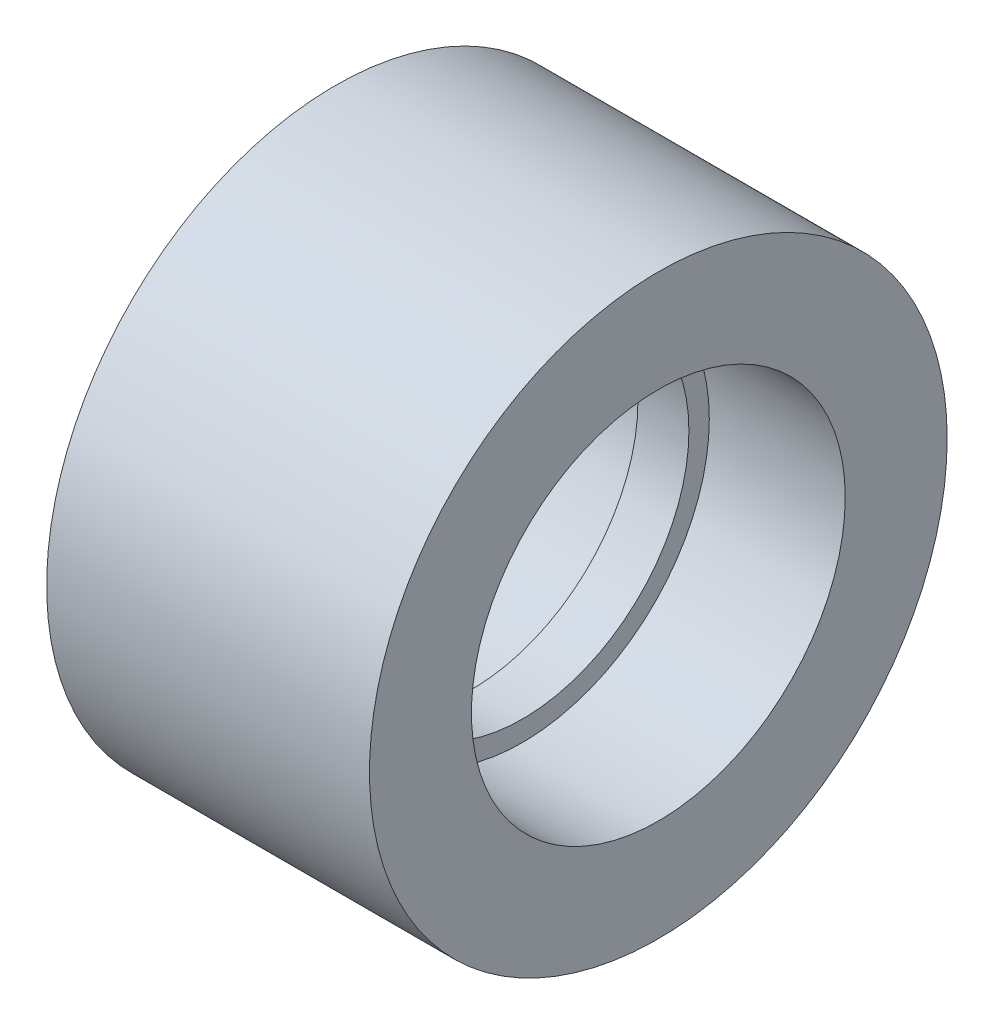
ISO-10303-21;
HEADER;
FILE_DESCRIPTION(('STEP AP214'),'2;1');
FILE_NAME('part.step','',(''),(''),'','','');
FILE_SCHEMA(('AUTOMOTIVE_DESIGN { 1 0 10303 214 1 1 1 1 }'));
ENDSEC;
DATA;
#1=APPLICATION_CONTEXT('core data for automotive mechanical design processes');
#2=APPLICATION_PROTOCOL_DEFINITION('international standard','automotive_design',2000,#1);
#3=PRODUCT_CONTEXT('',#1,'mechanical');
#4=PRODUCT('Part','Part','',(#3));
#5=PRODUCT_RELATED_PRODUCT_CATEGORY('part','',(#4));
#6=PRODUCT_DEFINITION_FORMATION('','',#4);
#7=PRODUCT_DEFINITION_CONTEXT('part definition',#1,'design');
#8=PRODUCT_DEFINITION('design','',#6,#7);
#9=PRODUCT_DEFINITION_SHAPE('','',#8);
#10=(LENGTH_UNIT() NAMED_UNIT(*) SI_UNIT(.MILLI.,.METRE.));
#11=(NAMED_UNIT(*) PLANE_ANGLE_UNIT() SI_UNIT($,.RADIAN.));
#12=(NAMED_UNIT(*) SI_UNIT($,.STERADIAN.) SOLID_ANGLE_UNIT());
#13=UNCERTAINTY_MEASURE_WITH_UNIT(LENGTH_MEASURE(1.E-05),#10,'distance_accuracy_value','');
#14=(GEOMETRIC_REPRESENTATION_CONTEXT(3) GLOBAL_UNCERTAINTY_ASSIGNED_CONTEXT((#13)) GLOBAL_UNIT_ASSIGNED_CONTEXT((#10,
#11,#12)) REPRESENTATION_CONTEXT('',''));
#15=CARTESIAN_POINT('',(0.,0.,0.));
#16=DIRECTION('',(0.,0.,1.));
#17=DIRECTION('',(1.,0.,0.));
#18=AXIS2_PLACEMENT_3D('',#15,#16,#17);
#19=CARTESIAN_POINT('',(-9.5,0.,-17.));
#20=DIRECTION('',(-1.,0.,0.));
#21=DIRECTION('',(0.,0.,1.));
#22=AXIS2_PLACEMENT_3D('',#19,#20,#21);
#23=PLANE('',#22);
#24=CARTESIAN_POINT('',(-9.49999999999999,0.,0.));
#25=DIRECTION('',(1.,0.,0.));
#26=DIRECTION('',(0.,0.,-1.));
#27=AXIS2_PLACEMENT_3D('',#24,#25,#26);
#28=CIRCLE('',#27,11.);
#29=CARTESIAN_POINT('',(-9.49999999999999,0.,-11.));
#30=VERTEX_POINT('',#29);
#31=EDGE_CURVE('E10',#30,#30,#28,.T.);
#32=ORIENTED_EDGE('',*,*,#31,.T.);
#33=EDGE_LOOP('',(#32));
#34=FACE_BOUND('',#33,.T.);
#35=CARTESIAN_POINT('',(-9.49999999999999,0.,0.));
#36=DIRECTION('',(1.,0.,0.));
#37=DIRECTION('',(0.,0.,-1.));
#38=AXIS2_PLACEMENT_3D('',#35,#36,#37);
#39=CIRCLE('',#38,17.);
#40=CARTESIAN_POINT('',(-9.49999999999999,0.,-17.));
#41=VERTEX_POINT('',#40);
#42=EDGE_CURVE('E63',#41,#41,#39,.T.);
#43=ORIENTED_EDGE('',*,*,#42,.F.);
#44=EDGE_LOOP('',(#43));
#45=FACE_BOUND('',#44,.T.);
#46=ADVANCED_FACE('F35',(#34,#45),#23,.T.);
#47=CARTESIAN_POINT('',(88.99,0.,0.));
#48=DIRECTION('',(1.,0.,0.));
#49=DIRECTION('',(0.,0.,-1.));
#50=AXIS2_PLACEMENT_3D('',#47,#48,#49);
#51=CYLINDRICAL_SURFACE('',#50,11.);
#52=CARTESIAN_POINT('',(-1.5,0.,0.));
#53=DIRECTION('',(1.,0.,0.));
#54=DIRECTION('',(0.,0.,-1.));
#55=AXIS2_PLACEMENT_3D('',#52,#53,#54);
#56=CIRCLE('',#55,11.);
#57=CARTESIAN_POINT('',(-1.5,0.,-11.));
#58=VERTEX_POINT('',#57);
#59=EDGE_CURVE('E41',#58,#58,#56,.T.);
#60=ORIENTED_EDGE('',*,*,#59,.T.);
#61=EDGE_LOOP('',(#60));
#62=FACE_BOUND('',#61,.T.);
#63=ORIENTED_EDGE('',*,*,#31,.F.);
#64=EDGE_LOOP('',(#63));
#65=FACE_BOUND('',#64,.T.);
#66=ADVANCED_FACE('F71',(#62,#65),#51,.F.);
#67=CARTESIAN_POINT('',(-1.5,0.,-11.));
#68=DIRECTION('',(-1.,0.,0.));
#69=DIRECTION('',(0.,0.,1.));
#70=AXIS2_PLACEMENT_3D('',#67,#68,#69);
#71=PLANE('',#70);
#72=CARTESIAN_POINT('',(-1.5,0.,0.));
#73=DIRECTION('',(1.,0.,0.));
#74=DIRECTION('',(0.,0.,-1.));
#75=AXIS2_PLACEMENT_3D('',#72,#73,#74);
#76=CIRCLE('',#75,9.8);
#77=CARTESIAN_POINT('',(-1.5,0.,-9.8));
#78=VERTEX_POINT('',#77);
#79=EDGE_CURVE('E45',#78,#78,#76,.T.);
#80=ORIENTED_EDGE('',*,*,#79,.T.);
#81=EDGE_LOOP('',(#80));
#82=FACE_BOUND('',#81,.T.);
#83=ORIENTED_EDGE('',*,*,#59,.F.);
#84=EDGE_LOOP('',(#83));
#85=FACE_BOUND('',#84,.T.);
#86=ADVANCED_FACE('F75',(#82,#85),#71,.T.);
#87=CARTESIAN_POINT('',(88.99,0.,0.));
#88=DIRECTION('',(1.,0.,0.));
#89=DIRECTION('',(0.,0.,-1.));
#90=AXIS2_PLACEMENT_3D('',#87,#88,#89);
#91=CYLINDRICAL_SURFACE('',#90,9.8);
#92=CARTESIAN_POINT('',(1.5,0.,0.));
#93=DIRECTION('',(1.,0.,0.));
#94=DIRECTION('',(0.,0.,-1.));
#95=AXIS2_PLACEMENT_3D('',#92,#93,#94);
#96=CIRCLE('',#95,9.8);
#97=CARTESIAN_POINT('',(1.5,0.,-9.8));
#98=VERTEX_POINT('',#97);
#99=EDGE_CURVE('E49',#98,#98,#96,.T.);
#100=ORIENTED_EDGE('',*,*,#99,.T.);
#101=EDGE_LOOP('',(#100));
#102=FACE_BOUND('',#101,.T.);
#103=ORIENTED_EDGE('',*,*,#79,.F.);
#104=EDGE_LOOP('',(#103));
#105=FACE_BOUND('',#104,.T.);
#106=ADVANCED_FACE('F79',(#102,#105),#91,.F.);
#107=CARTESIAN_POINT('',(1.5,0.,-11.));
#108=DIRECTION('',(1.,0.,0.));
#109=DIRECTION('',(0.,0.,-1.));
#110=AXIS2_PLACEMENT_3D('',#107,#108,#109);
#111=PLANE('',#110);
#112=CARTESIAN_POINT('',(1.5,0.,0.));
#113=DIRECTION('',(1.,0.,0.));
#114=DIRECTION('',(0.,0.,-1.));
#115=AXIS2_PLACEMENT_3D('',#112,#113,#114);
#116=CIRCLE('',#115,11.);
#117=CARTESIAN_POINT('',(1.5,0.,-11.));
#118=VERTEX_POINT('',#117);
#119=EDGE_CURVE('E54',#118,#118,#116,.T.);
#120=ORIENTED_EDGE('',*,*,#119,.T.);
#121=EDGE_LOOP('',(#120));
#122=FACE_BOUND('',#121,.T.);
#123=ORIENTED_EDGE('',*,*,#99,.F.);
#124=EDGE_LOOP('',(#123));
#125=FACE_BOUND('',#124,.T.);
#126=ADVANCED_FACE('F86',(#122,#125),#111,.T.);
#127=CARTESIAN_POINT('',(88.99,0.,0.));
#128=DIRECTION('',(1.,0.,0.));
#129=DIRECTION('',(0.,0.,-1.));
#130=AXIS2_PLACEMENT_3D('',#127,#128,#129);
#131=CYLINDRICAL_SURFACE('',#130,11.);
#132=CARTESIAN_POINT('',(9.49999999999999,0.,0.));
#133=DIRECTION('',(1.,0.,0.));
#134=DIRECTION('',(0.,0.,-1.));
#135=AXIS2_PLACEMENT_3D('',#132,#133,#134);
#136=CIRCLE('',#135,11.);
#137=CARTESIAN_POINT('',(9.49999999999999,0.,-11.));
#138=VERTEX_POINT('',#137);
#139=EDGE_CURVE('E57',#138,#138,#136,.T.);
#140=ORIENTED_EDGE('',*,*,#139,.T.);
#141=EDGE_LOOP('',(#140));
#142=FACE_BOUND('',#141,.T.);
#143=ORIENTED_EDGE('',*,*,#119,.F.);
#144=EDGE_LOOP('',(#143));
#145=FACE_BOUND('',#144,.T.);
#146=ADVANCED_FACE('F90',(#142,#145),#131,.F.);
#147=CARTESIAN_POINT('',(9.5,0.,-17.));
#148=DIRECTION('',(1.,0.,0.));
#149=DIRECTION('',(0.,0.,-1.));
#150=AXIS2_PLACEMENT_3D('',#147,#148,#149);
#151=PLANE('',#150);
#152=CARTESIAN_POINT('',(9.49999999999999,0.,0.));
#153=DIRECTION('',(1.,0.,0.));
#154=DIRECTION('',(0.,0.,-1.));
#155=AXIS2_PLACEMENT_3D('',#152,#153,#154);
#156=CIRCLE('',#155,17.);
#157=CARTESIAN_POINT('',(9.49999999999999,0.,-17.));
#158=VERTEX_POINT('',#157);
#159=EDGE_CURVE('E60',#158,#158,#156,.T.);
#160=ORIENTED_EDGE('',*,*,#159,.T.);
#161=EDGE_LOOP('',(#160));
#162=FACE_BOUND('',#161,.T.);
#163=ORIENTED_EDGE('',*,*,#139,.F.);
#164=EDGE_LOOP('',(#163));
#165=FACE_BOUND('',#164,.T.);
#166=ADVANCED_FACE('F94',(#162,#165),#151,.T.);
#167=CARTESIAN_POINT('',(88.99,0.,0.));
#168=DIRECTION('',(1.,0.,0.));
#169=DIRECTION('',(0.,0.,-1.));
#170=AXIS2_PLACEMENT_3D('',#167,#168,#169);
#171=CYLINDRICAL_SURFACE('',#170,17.);
#172=ORIENTED_EDGE('',*,*,#42,.T.);
#173=EDGE_LOOP('',(#172));
#174=FACE_BOUND('',#173,.T.);
#175=ORIENTED_EDGE('',*,*,#159,.F.);
#176=EDGE_LOOP('',(#175));
#177=FACE_BOUND('',#176,.T.);
#178=ADVANCED_FACE('F67',(#174,#177),#171,.T.);
#179=CLOSED_SHELL('',(#46,#66,#86,#106,#126,#146,#166,#178));
#180=MANIFOLD_SOLID_BREP('B2',#179);
#181=ADVANCED_BREP_SHAPE_REPRESENTATION('',(#18,#180),#14);
#182=SHAPE_DEFINITION_REPRESENTATION(#9,#181);
ENDSEC;
END-ISO-10303-21;
